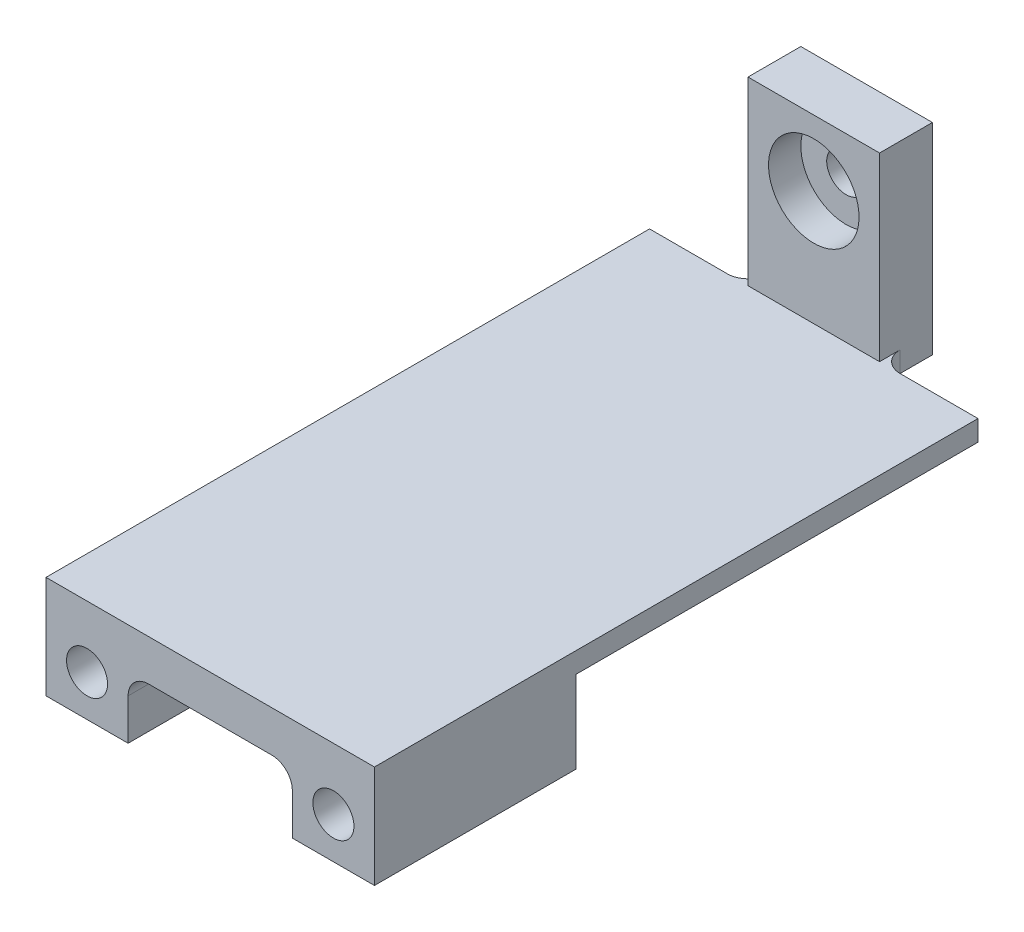
ISO-10303-21;
HEADER;
FILE_DESCRIPTION(('STEP AP214'),'2;1');
FILE_NAME('part.step','',(''),(''),'','','');
FILE_SCHEMA(('AUTOMOTIVE_DESIGN { 1 0 10303 214 1 1 1 1 }'));
ENDSEC;
DATA;
#1=APPLICATION_CONTEXT('core data for automotive mechanical design processes');
#2=APPLICATION_PROTOCOL_DEFINITION('international standard','automotive_design',2000,#1);
#3=PRODUCT_CONTEXT('',#1,'mechanical');
#4=PRODUCT('Part','Part','',(#3));
#5=PRODUCT_RELATED_PRODUCT_CATEGORY('part','',(#4));
#6=PRODUCT_DEFINITION_FORMATION('','',#4);
#7=PRODUCT_DEFINITION_CONTEXT('part definition',#1,'design');
#8=PRODUCT_DEFINITION('design','',#6,#7);
#9=PRODUCT_DEFINITION_SHAPE('','',#8);
#10=(LENGTH_UNIT() NAMED_UNIT(*) SI_UNIT(.MILLI.,.METRE.));
#11=(NAMED_UNIT(*) PLANE_ANGLE_UNIT() SI_UNIT($,.RADIAN.));
#12=(NAMED_UNIT(*) SI_UNIT($,.STERADIAN.) SOLID_ANGLE_UNIT());
#13=UNCERTAINTY_MEASURE_WITH_UNIT(LENGTH_MEASURE(1.E-05),#10,'distance_accuracy_value','');
#14=(GEOMETRIC_REPRESENTATION_CONTEXT(3) GLOBAL_UNCERTAINTY_ASSIGNED_CONTEXT((#13)) GLOBAL_UNIT_ASSIGNED_CONTEXT((#10,
#11,#12)) REPRESENTATION_CONTEXT('',''));
#15=CARTESIAN_POINT('',(0.,0.,0.));
#16=DIRECTION('',(0.,0.,1.));
#17=DIRECTION('',(1.,0.,0.));
#18=AXIS2_PLACEMENT_3D('',#15,#16,#17);
#19=CARTESIAN_POINT('',(88.9,12.7,50.8));
#20=DIRECTION('',(-1.,0.,0.));
#21=DIRECTION('',(0.,0.,1.));
#22=AXIS2_PLACEMENT_3D('',#19,#20,#21);
#23=PLANE('',#22);
#24=DIRECTION('',(0.,-1.,0.));
#25=VECTOR('',#24,1.);
#26=CARTESIAN_POINT('',(88.9,-19.05,-11.55));
#27=LINE('',#26,#25);
#28=CARTESIAN_POINT('',(88.9,6.35,-11.55));
#29=VERTEX_POINT('',#28);
#30=CARTESIAN_POINT('',(88.9,-19.05,-11.55));
#31=VERTEX_POINT('',#30);
#32=EDGE_CURVE('E178',#29,#31,#27,.T.);
#33=ORIENTED_EDGE('',*,*,#32,.F.);
#34=DIRECTION('',(0.,0.,1.));
#35=VECTOR('',#34,1.);
#36=CARTESIAN_POINT('',(88.9,6.35,-50.8));
#37=LINE('',#36,#35);
#38=CARTESIAN_POINT('',(88.9,6.35,-135.89));
#39=VERTEX_POINT('',#38);
#40=EDGE_CURVE('E340',#39,#29,#37,.T.);
#41=ORIENTED_EDGE('',*,*,#40,.F.);
#42=DIRECTION('',(0.,-1.,0.));
#43=VECTOR('',#42,1.);
#44=CARTESIAN_POINT('',(88.9,12.7,-135.89));
#45=LINE('',#44,#43);
#46=CARTESIAN_POINT('',(88.9,12.7,-135.89));
#47=VERTEX_POINT('',#46);
#48=EDGE_CURVE('E296',#47,#39,#45,.T.);
#49=ORIENTED_EDGE('',*,*,#48,.F.);
#50=DIRECTION('',(0.,0.,-1.));
#51=VECTOR('',#50,1.);
#52=CARTESIAN_POINT('',(88.9,12.7,50.8));
#53=LINE('',#52,#51);
#54=CARTESIAN_POINT('',(88.9,12.7,50.8));
#55=VERTEX_POINT('',#54);
#56=EDGE_CURVE('E228',#55,#47,#53,.T.);
#57=ORIENTED_EDGE('',*,*,#56,.F.);
#58=DIRECTION('',(0.,-1.,0.));
#59=VECTOR('',#58,1.);
#60=CARTESIAN_POINT('',(88.9,12.7,50.8));
#61=LINE('',#60,#59);
#62=CARTESIAN_POINT('',(88.9,-19.05,50.8));
#63=VERTEX_POINT('',#62);
#64=EDGE_CURVE('E203',#55,#63,#61,.T.);
#65=ORIENTED_EDGE('',*,*,#64,.T.);
#66=DIRECTION('',(0.,0.,1.));
#67=VECTOR('',#66,1.);
#68=CARTESIAN_POINT('',(88.9,-19.05,-82.55));
#69=LINE('',#68,#67);
#70=EDGE_CURVE('E196',#31,#63,#69,.T.);
#71=ORIENTED_EDGE('',*,*,#70,.F.);
#72=EDGE_LOOP('',(#33,#41,#49,#57,#65,#71));
#73=FACE_BOUND('',#72,.T.);
#74=ADVANCED_FACE('F40',(#73),#23,.F.);
#75=CARTESIAN_POINT('',(-12.7,-19.05,-82.55));
#76=DIRECTION('',(-1.,0.,0.));
#77=DIRECTION('',(0.,0.,1.));
#78=AXIS2_PLACEMENT_3D('',#75,#76,#77);
#79=PLANE('',#78);
#80=DIRECTION('',(0.,0.,-1.));
#81=VECTOR('',#80,1.);
#82=CARTESIAN_POINT('',(-12.7,6.35,-82.55));
#83=LINE('',#82,#81);
#84=CARTESIAN_POINT('',(-12.7,6.35,-11.55));
#85=VERTEX_POINT('',#84);
#86=CARTESIAN_POINT('',(-12.7,6.35,-135.89));
#87=VERTEX_POINT('',#86);
#88=EDGE_CURVE('E330',#85,#87,#83,.T.);
#89=ORIENTED_EDGE('',*,*,#88,.F.);
#90=DIRECTION('',(0.,1.,0.));
#91=VECTOR('',#90,1.);
#92=CARTESIAN_POINT('',(-12.7,-19.05,-11.55));
#93=LINE('',#92,#91);
#94=CARTESIAN_POINT('',(-12.7,-19.05,-11.55));
#95=VERTEX_POINT('',#94);
#96=EDGE_CURVE('E199',#95,#85,#93,.T.);
#97=ORIENTED_EDGE('',*,*,#96,.F.);
#98=DIRECTION('',(0.,0.,1.));
#99=VECTOR('',#98,1.);
#100=CARTESIAN_POINT('',(-12.7,-19.05,-82.55));
#101=LINE('',#100,#99);
#102=CARTESIAN_POINT('',(-12.7,-19.05,50.8));
#103=VERTEX_POINT('',#102);
#104=EDGE_CURVE('E224',#95,#103,#101,.T.);
#105=ORIENTED_EDGE('',*,*,#104,.T.);
#106=DIRECTION('',(0.,-1.,0.));
#107=VECTOR('',#106,1.);
#108=CARTESIAN_POINT('',(-12.7,-19.05,50.8));
#109=LINE('',#108,#107);
#110=CARTESIAN_POINT('',(-12.7,12.7,50.8));
#111=VERTEX_POINT('',#110);
#112=EDGE_CURVE('E220',#111,#103,#109,.T.);
#113=ORIENTED_EDGE('',*,*,#112,.F.);
#114=DIRECTION('',(0.,0.,-1.));
#115=VECTOR('',#114,1.);
#116=CARTESIAN_POINT('',(-12.7,12.7,133.35));
#117=LINE('',#116,#115);
#118=CARTESIAN_POINT('',(-12.7,12.7,-135.89));
#119=VERTEX_POINT('',#118);
#120=EDGE_CURVE('E285',#111,#119,#117,.T.);
#121=ORIENTED_EDGE('',*,*,#120,.T.);
#122=DIRECTION('',(0.,1.,0.));
#123=VECTOR('',#122,1.);
#124=CARTESIAN_POINT('',(-12.7,12.7,-135.89));
#125=LINE('',#124,#123);
#126=EDGE_CURVE('E282',#87,#119,#125,.T.);
#127=ORIENTED_EDGE('',*,*,#126,.F.);
#128=EDGE_LOOP('',(#89,#97,#105,#113,#121,#127));
#129=FACE_BOUND('',#128,.T.);
#130=ADVANCED_FACE('F403',(#129),#79,.T.);
#131=CARTESIAN_POINT('',(38.1,48.26,-152.24));
#132=DIRECTION('',(0.,0.,1.));
#133=DIRECTION('',(1.,0.,0.));
#134=AXIS2_PLACEMENT_3D('',#131,#132,#133);
#135=CYLINDRICAL_SURFACE('',#134,5.99999999999999);
#136=CARTESIAN_POINT('',(38.1,48.26,-152.24));
#137=DIRECTION('',(0.,0.,-1.));
#138=DIRECTION('',(-1.,0.,0.));
#139=AXIS2_PLACEMENT_3D('',#136,#137,#138);
#140=CIRCLE('',#139,5.99999999999999);
#141=CARTESIAN_POINT('',(32.1,48.26,-152.24));
#142=VERTEX_POINT('',#141);
#143=EDGE_CURVE('E253',#142,#142,#140,.T.);
#144=ORIENTED_EDGE('',*,*,#143,.T.);
#145=EDGE_LOOP('',(#144));
#146=FACE_BOUND('',#145,.T.);
#147=CARTESIAN_POINT('',(38.1,48.26,-145.89));
#148=DIRECTION('',(0.,0.,1.));
#149=DIRECTION('',(1.,0.,0.));
#150=AXIS2_PLACEMENT_3D('',#147,#148,#149);
#151=CIRCLE('',#150,5.99999999999999);
#152=CARTESIAN_POINT('',(44.1,48.26,-145.89));
#153=VERTEX_POINT('',#152);
#154=EDGE_CURVE('E250',#153,#153,#151,.T.);
#155=ORIENTED_EDGE('',*,*,#154,.T.);
#156=EDGE_LOOP('',(#155));
#157=FACE_BOUND('',#156,.T.);
#158=ADVANCED_FACE('F408',(#146,#157),#135,.F.);
#159=CARTESIAN_POINT('',(0.,0.,-135.89));
#160=DIRECTION('',(0.,0.,-1.));
#161=DIRECTION('',(-1.,0.,0.));
#162=AXIS2_PLACEMENT_3D('',#159,#160,#161);
#163=PLANE('',#162);
#164=DIRECTION('',(1.,0.,0.));
#165=VECTOR('',#164,1.);
#166=CARTESIAN_POINT('',(0.,6.35,-135.89));
#167=LINE('',#166,#165);
#168=CARTESIAN_POINT('',(11.4,6.35,-135.89));
#169=VERTEX_POINT('',#168);
#170=EDGE_CURVE('E55',#87,#169,#167,.T.);
#171=ORIENTED_EDGE('',*,*,#170,.F.);
#172=ORIENTED_EDGE('',*,*,#126,.T.);
#173=DIRECTION('',(1.,0.,0.));
#174=VECTOR('',#173,1.);
#175=CARTESIAN_POINT('',(88.9,12.7,-135.89));
#176=LINE('',#175,#174);
#177=CARTESIAN_POINT('',(11.4,12.7,-135.89));
#178=VERTEX_POINT('',#177);
#179=EDGE_CURVE('E281',#119,#178,#176,.T.);
#180=ORIENTED_EDGE('',*,*,#179,.T.);
#181=DIRECTION('',(0.,1.,0.));
#182=VECTOR('',#181,1.);
#183=CARTESIAN_POINT('',(11.4,0.,-135.89));
#184=LINE('',#183,#182);
#185=EDGE_CURVE('E265',#178,#169,#184,.F.);
#186=ORIENTED_EDGE('',*,*,#185,.T.);
#187=EDGE_LOOP('',(#171,#172,#180,#186));
#188=FACE_BOUND('',#187,.T.);
#189=ADVANCED_FACE('F278',(#188),#163,.T.);
#190=CARTESIAN_POINT('',(0.,0.,0.));
#191=DIRECTION('',(0.,-1.,0.));
#192=DIRECTION('',(0.,0.,-1.));
#193=AXIS2_PLACEMENT_3D('',#190,#191,#192);
#194=PLANE('',#193);
#195=DIRECTION('',(-1.,0.,0.));
#196=VECTOR('',#195,1.);
#197=CARTESIAN_POINT('',(0.,0.,-11.55));
#198=LINE('',#197,#196);
#199=CARTESIAN_POINT('',(57.15,0.,-11.55));
#200=VERTEX_POINT('',#199);
#201=CARTESIAN_POINT('',(19.05,0.,-11.55));
#202=VERTEX_POINT('',#201);
#203=EDGE_CURVE('E353',#200,#202,#198,.T.);
#204=ORIENTED_EDGE('',*,*,#203,.F.);
#205=DIRECTION('',(0.,0.,1.));
#206=VECTOR('',#205,1.);
#207=CARTESIAN_POINT('',(57.15,0.,0.));
#208=LINE('',#207,#206);
#209=CARTESIAN_POINT('',(57.15,0.,50.8));
#210=VERTEX_POINT('',#209);
#211=EDGE_CURVE('E239',#200,#210,#208,.T.);
#212=ORIENTED_EDGE('',*,*,#211,.T.);
#213=DIRECTION('',(1.,0.,0.));
#214=VECTOR('',#213,1.);
#215=CARTESIAN_POINT('',(-88.9,0.,50.8));
#216=LINE('',#215,#214);
#217=CARTESIAN_POINT('',(19.05,0.,50.8));
#218=VERTEX_POINT('',#217);
#219=EDGE_CURVE('E226',#218,#210,#216,.T.);
#220=ORIENTED_EDGE('',*,*,#219,.F.);
#221=DIRECTION('',(0.,0.,1.));
#222=VECTOR('',#221,1.);
#223=CARTESIAN_POINT('',(19.05,0.,-50.8));
#224=LINE('',#223,#222);
#225=EDGE_CURVE('E236',#218,#202,#224,.F.);
#226=ORIENTED_EDGE('',*,*,#225,.T.);
#227=EDGE_LOOP('',(#204,#212,#220,#226));
#228=FACE_BOUND('',#227,.T.);
#229=ADVANCED_FACE('F457',(#228),#194,.T.);
#230=CARTESIAN_POINT('',(-88.9,12.7,50.8));
#231=DIRECTION('',(0.,0.,-1.));
#232=DIRECTION('',(-1.,0.,0.));
#233=AXIS2_PLACEMENT_3D('',#230,#231,#232);
#234=PLANE('',#233);
#235=CARTESIAN_POINT('',(76.2,-6.35,50.8));
#236=DIRECTION('',(0.,0.,1.));
#237=DIRECTION('',(1.,0.,0.));
#238=AXIS2_PLACEMENT_3D('',#235,#236,#237);
#239=CIRCLE('',#238,6.35);
#240=CARTESIAN_POINT('',(82.55,-6.35,50.8));
#241=VERTEX_POINT('',#240);
#242=EDGE_CURVE('E289',#241,#241,#239,.T.);
#243=ORIENTED_EDGE('',*,*,#242,.F.);
#244=EDGE_LOOP('',(#243));
#245=FACE_BOUND('',#244,.T.);
#246=CARTESIAN_POINT('',(0.,-6.35,50.8));
#247=DIRECTION('',(0.,0.,1.));
#248=DIRECTION('',(1.,0.,0.));
#249=AXIS2_PLACEMENT_3D('',#246,#247,#248);
#250=CIRCLE('',#249,6.35);
#251=CARTESIAN_POINT('',(6.35,-6.35,50.8));
#252=VERTEX_POINT('',#251);
#253=EDGE_CURVE('E205',#252,#252,#250,.T.);
#254=ORIENTED_EDGE('',*,*,#253,.F.);
#255=EDGE_LOOP('',(#254));
#256=FACE_BOUND('',#255,.T.);
#257=DIRECTION('',(1.,0.,0.));
#258=VECTOR('',#257,1.);
#259=CARTESIAN_POINT('',(-88.9,12.7,50.8));
#260=LINE('',#259,#258);
#261=EDGE_CURVE('E231',#111,#55,#260,.T.);
#262=ORIENTED_EDGE('',*,*,#261,.F.);
#263=ORIENTED_EDGE('',*,*,#112,.T.);
#264=DIRECTION('',(1.,0.,0.));
#265=VECTOR('',#264,1.);
#266=CARTESIAN_POINT('',(12.7,-19.05,50.8));
#267=LINE('',#266,#265);
#268=CARTESIAN_POINT('',(12.7,-19.05,50.8));
#269=VERTEX_POINT('',#268);
#270=EDGE_CURVE('E208',#103,#269,#267,.T.);
#271=ORIENTED_EDGE('',*,*,#270,.T.);
#272=DIRECTION('',(0.,1.,0.));
#273=VECTOR('',#272,1.);
#274=CARTESIAN_POINT('',(12.7,-19.05,50.8));
#275=LINE('',#274,#273);
#276=CARTESIAN_POINT('',(12.7,-6.35,50.8));
#277=VERTEX_POINT('',#276);
#278=EDGE_CURVE('E217',#269,#277,#275,.T.);
#279=ORIENTED_EDGE('',*,*,#278,.T.);
#280=CARTESIAN_POINT('',(19.05,-6.35,50.8));
#281=DIRECTION('',(0.,0.,-1.));
#282=DIRECTION('',(-1.,0.,0.));
#283=AXIS2_PLACEMENT_3D('',#280,#281,#282);
#284=CIRCLE('',#283,6.35);
#285=EDGE_CURVE('E248',#277,#218,#284,.T.);
#286=ORIENTED_EDGE('',*,*,#285,.T.);
#287=ORIENTED_EDGE('',*,*,#219,.T.);
#288=CARTESIAN_POINT('',(57.15,-6.35,50.8));
#289=DIRECTION('',(0.,0.,-1.));
#290=DIRECTION('',(-1.,0.,0.));
#291=AXIS2_PLACEMENT_3D('',#288,#289,#290);
#292=CIRCLE('',#291,6.35);
#293=CARTESIAN_POINT('',(63.5,-6.35,50.8));
#294=VERTEX_POINT('',#293);
#295=EDGE_CURVE('E246',#210,#294,#292,.T.);
#296=ORIENTED_EDGE('',*,*,#295,.T.);
#297=DIRECTION('',(0.,1.,0.));
#298=VECTOR('',#297,1.);
#299=CARTESIAN_POINT('',(63.5,-19.05,50.8));
#300=LINE('',#299,#298);
#301=CARTESIAN_POINT('',(63.5,-19.05,50.8));
#302=VERTEX_POINT('',#301);
#303=EDGE_CURVE('E495',#302,#294,#300,.T.);
#304=ORIENTED_EDGE('',*,*,#303,.F.);
#305=DIRECTION('',(-1.,0.,0.));
#306=VECTOR('',#305,1.);
#307=CARTESIAN_POINT('',(88.9,-19.05,50.8));
#308=LINE('',#307,#306);
#309=EDGE_CURVE('E210',#63,#302,#308,.T.);
#310=ORIENTED_EDGE('',*,*,#309,.F.);
#311=ORIENTED_EDGE('',*,*,#64,.F.);
#312=EDGE_LOOP('',(#262,#263,#271,#279,#286,#287,#296,#304,#310,#311));
#313=FACE_BOUND('',#312,.T.);
#314=ADVANCED_FACE('F412',(#245,#256,#313),#234,.F.);
#315=CARTESIAN_POINT('',(0.,12.7,0.));
#316=DIRECTION('',(0.,-1.,0.));
#317=DIRECTION('',(0.,0.,-1.));
#318=AXIS2_PLACEMENT_3D('',#315,#316,#317);
#319=PLANE('',#318);
#320=ORIENTED_EDGE('',*,*,#56,.T.);
#321=CARTESIAN_POINT('',(64.8,12.7,-135.89));
#322=VERTEX_POINT('',#321);
#323=EDGE_CURVE('E288',#322,#47,#176,.T.);
#324=ORIENTED_EDGE('',*,*,#323,.F.);
#325=CARTESIAN_POINT('',(64.8,12.7,-142.24));
#326=DIRECTION('',(0.,-1.,0.));
#327=DIRECTION('',(0.,0.,-1.));
#328=AXIS2_PLACEMENT_3D('',#325,#326,#327);
#329=CIRCLE('',#328,6.35);
#330=CARTESIAN_POINT('',(58.45,12.7,-142.24));
#331=VERTEX_POINT('',#330);
#332=EDGE_CURVE('E268',#322,#331,#329,.T.);
#333=ORIENTED_EDGE('',*,*,#332,.T.);
#334=DIRECTION('',(0.,0.,-1.));
#335=VECTOR('',#334,1.);
#336=CARTESIAN_POINT('',(58.45,12.7,0.));
#337=LINE('',#336,#335);
#338=CARTESIAN_POINT('',(58.45,12.7,-135.89));
#339=VERTEX_POINT('',#338);
#340=EDGE_CURVE('E63',#339,#331,#337,.T.);
#341=ORIENTED_EDGE('',*,*,#340,.F.);
#342=CARTESIAN_POINT('',(17.75,12.7,-135.89));
#343=VERTEX_POINT('',#342);
#344=EDGE_CURVE('E286',#343,#339,#176,.T.);
#345=ORIENTED_EDGE('',*,*,#344,.F.);
#346=DIRECTION('',(0.,0.,1.));
#347=VECTOR('',#346,1.);
#348=CARTESIAN_POINT('',(17.75,12.7,0.));
#349=LINE('',#348,#347);
#350=CARTESIAN_POINT('',(17.75,12.7,-142.24));
#351=VERTEX_POINT('',#350);
#352=EDGE_CURVE('E261',#351,#343,#349,.T.);
#353=ORIENTED_EDGE('',*,*,#352,.F.);
#354=CARTESIAN_POINT('',(11.4,12.7,-142.24));
#355=DIRECTION('',(0.,-1.,0.));
#356=DIRECTION('',(0.,0.,-1.));
#357=AXIS2_PLACEMENT_3D('',#354,#355,#356);
#358=CIRCLE('',#357,6.35);
#359=EDGE_CURVE('E270',#351,#178,#358,.T.);
#360=ORIENTED_EDGE('',*,*,#359,.T.);
#361=ORIENTED_EDGE('',*,*,#179,.F.);
#362=ORIENTED_EDGE('',*,*,#120,.F.);
#363=ORIENTED_EDGE('',*,*,#261,.T.);
#364=EDGE_LOOP('',(#320,#324,#333,#341,#345,#353,#360,#361,#362,#363));
#365=FACE_BOUND('',#364,.T.);
#366=ADVANCED_FACE('F371',(#365),#319,.F.);
#367=CARTESIAN_POINT('',(12.7,-19.05,-82.55));
#368=DIRECTION('',(0.,-1.,0.));
#369=DIRECTION('',(0.,0.,-1.));
#370=AXIS2_PLACEMENT_3D('',#367,#368,#369);
#371=PLANE('',#370);
#372=DIRECTION('',(-1.,0.,0.));
#373=VECTOR('',#372,1.);
#374=CARTESIAN_POINT('',(88.9,-19.05,-11.55));
#375=LINE('',#374,#373);
#376=CARTESIAN_POINT('',(12.7,-19.05,-11.55));
#377=VERTEX_POINT('',#376);
#378=EDGE_CURVE('E190',#377,#95,#375,.T.);
#379=ORIENTED_EDGE('',*,*,#378,.F.);
#380=DIRECTION('',(0.,0.,1.));
#381=VECTOR('',#380,1.);
#382=CARTESIAN_POINT('',(12.7,-19.05,-82.55));
#383=LINE('',#382,#381);
#384=EDGE_CURVE('E223',#377,#269,#383,.T.);
#385=ORIENTED_EDGE('',*,*,#384,.T.);
#386=ORIENTED_EDGE('',*,*,#270,.F.);
#387=ORIENTED_EDGE('',*,*,#104,.F.);
#388=EDGE_LOOP('',(#379,#385,#386,#387));
#389=FACE_BOUND('',#388,.T.);
#390=ADVANCED_FACE('F470',(#389),#371,.T.);
#391=CARTESIAN_POINT('',(12.7,-19.05,-82.55));
#392=DIRECTION('',(1.,0.,0.));
#393=DIRECTION('',(0.,1.,0.));
#394=AXIS2_PLACEMENT_3D('',#391,#392,#393);
#395=PLANE('',#394);
#396=DIRECTION('',(0.,-1.,0.));
#397=VECTOR('',#396,1.);
#398=CARTESIAN_POINT('',(12.7,-19.05,-11.55));
#399=LINE('',#398,#397);
#400=CARTESIAN_POINT('',(12.7,-6.35,-11.55));
#401=VERTEX_POINT('',#400);
#402=EDGE_CURVE('E355',#401,#377,#399,.T.);
#403=ORIENTED_EDGE('',*,*,#402,.F.);
#404=DIRECTION('',(0.,0.,1.));
#405=VECTOR('',#404,1.);
#406=CARTESIAN_POINT('',(12.7,-6.35,50.8));
#407=LINE('',#406,#405);
#408=EDGE_CURVE('E244',#401,#277,#407,.T.);
#409=ORIENTED_EDGE('',*,*,#408,.T.);
#410=ORIENTED_EDGE('',*,*,#278,.F.);
#411=ORIENTED_EDGE('',*,*,#384,.F.);
#412=EDGE_LOOP('',(#403,#409,#410,#411));
#413=FACE_BOUND('',#412,.T.);
#414=ADVANCED_FACE('F473',(#413),#395,.T.);
#415=CARTESIAN_POINT('',(0.,-6.35,-68.7605122421383));
#416=DIRECTION('',(0.,0.,1.));
#417=DIRECTION('',(1.,0.,0.));
#418=AXIS2_PLACEMENT_3D('',#415,#416,#417);
#419=CYLINDRICAL_SURFACE('',#418,6.35);
#420=CARTESIAN_POINT('',(0.,-6.35,-11.55));
#421=DIRECTION('',(0.,0.,1.));
#422=DIRECTION('',(1.,0.,0.));
#423=AXIS2_PLACEMENT_3D('',#420,#421,#422);
#424=CIRCLE('',#423,6.35);
#425=CARTESIAN_POINT('',(6.35,-6.35,-11.55));
#426=VERTEX_POINT('',#425);
#427=EDGE_CURVE('E342',#426,#426,#424,.F.);
#428=ORIENTED_EDGE('',*,*,#427,.T.);
#429=EDGE_LOOP('',(#428));
#430=FACE_BOUND('',#429,.T.);
#431=ORIENTED_EDGE('',*,*,#253,.T.);
#432=EDGE_LOOP('',(#431));
#433=FACE_BOUND('',#432,.T.);
#434=ADVANCED_FACE('F476',(#430,#433),#419,.F.);
#435=CARTESIAN_POINT('',(63.5,-19.05,-82.55));
#436=DIRECTION('',(1.,0.,0.));
#437=DIRECTION('',(0.,0.,-1.));
#438=AXIS2_PLACEMENT_3D('',#435,#436,#437);
#439=PLANE('',#438);
#440=DIRECTION('',(0.,0.,1.));
#441=VECTOR('',#440,1.);
#442=CARTESIAN_POINT('',(63.5,-6.35,-82.55));
#443=LINE('',#442,#441);
#444=CARTESIAN_POINT('',(63.5,-6.35,-11.55));
#445=VERTEX_POINT('',#444);
#446=EDGE_CURVE('E241',#294,#445,#443,.F.);
#447=ORIENTED_EDGE('',*,*,#446,.T.);
#448=DIRECTION('',(0.,-1.,0.));
#449=VECTOR('',#448,1.);
#450=CARTESIAN_POINT('',(63.5,-19.05,-11.55));
#451=LINE('',#450,#449);
#452=CARTESIAN_POINT('',(63.5,-19.05,-11.55));
#453=VERTEX_POINT('',#452);
#454=EDGE_CURVE('E348',#445,#453,#451,.T.);
#455=ORIENTED_EDGE('',*,*,#454,.T.);
#456=DIRECTION('',(0.,0.,1.));
#457=VECTOR('',#456,1.);
#458=CARTESIAN_POINT('',(63.5,-19.05,-82.55));
#459=LINE('',#458,#457);
#460=EDGE_CURVE('E198',#453,#302,#459,.T.);
#461=ORIENTED_EDGE('',*,*,#460,.T.);
#462=ORIENTED_EDGE('',*,*,#303,.T.);
#463=EDGE_LOOP('',(#447,#455,#461,#462));
#464=FACE_BOUND('',#463,.T.);
#465=ADVANCED_FACE('F481',(#464),#439,.F.);
#466=CARTESIAN_POINT('',(88.9,-19.05,-82.55));
#467=DIRECTION('',(0.,1.,0.));
#468=DIRECTION('',(0.,0.,1.));
#469=AXIS2_PLACEMENT_3D('',#466,#467,#468);
#470=PLANE('',#469);
#471=ORIENTED_EDGE('',*,*,#460,.F.);
#472=EDGE_CURVE('E182',#31,#453,#375,.T.);
#473=ORIENTED_EDGE('',*,*,#472,.F.);
#474=ORIENTED_EDGE('',*,*,#70,.T.);
#475=ORIENTED_EDGE('',*,*,#309,.T.);
#476=EDGE_LOOP('',(#471,#473,#474,#475));
#477=FACE_BOUND('',#476,.T.);
#478=ADVANCED_FACE('F194',(#477),#470,.F.);
#479=CARTESIAN_POINT('',(76.2,-6.35,-68.7605122421383));
#480=DIRECTION('',(0.,0.,1.));
#481=DIRECTION('',(1.,0.,0.));
#482=AXIS2_PLACEMENT_3D('',#479,#480,#481);
#483=CYLINDRICAL_SURFACE('',#482,6.35);
#484=CARTESIAN_POINT('',(76.2,-6.35,-11.55));
#485=DIRECTION('',(0.,0.,1.));
#486=DIRECTION('',(1.,0.,0.));
#487=AXIS2_PLACEMENT_3D('',#484,#485,#486);
#488=CIRCLE('',#487,6.35);
#489=CARTESIAN_POINT('',(82.55,-6.35,-11.55));
#490=VERTEX_POINT('',#489);
#491=EDGE_CURVE('E345',#490,#490,#488,.F.);
#492=ORIENTED_EDGE('',*,*,#491,.T.);
#493=EDGE_LOOP('',(#492));
#494=FACE_BOUND('',#493,.T.);
#495=ORIENTED_EDGE('',*,*,#242,.T.);
#496=EDGE_LOOP('',(#495));
#497=FACE_BOUND('',#496,.T.);
#498=ADVANCED_FACE('F418',(#494,#497),#483,.F.);
#499=CARTESIAN_POINT('',(57.15,-6.35,0.));
#500=DIRECTION('',(0.,0.,1.));
#501=DIRECTION('',(1.,0.,0.));
#502=AXIS2_PLACEMENT_3D('',#499,#500,#501);
#503=CYLINDRICAL_SURFACE('',#502,6.35);
#504=ORIENTED_EDGE('',*,*,#211,.F.);
#505=CARTESIAN_POINT('',(57.15,-6.35,-11.55));
#506=DIRECTION('',(0.,0.,1.));
#507=DIRECTION('',(1.,0.,0.));
#508=AXIS2_PLACEMENT_3D('',#505,#506,#507);
#509=CIRCLE('',#508,6.35);
#510=EDGE_CURVE('E350',#200,#445,#509,.F.);
#511=ORIENTED_EDGE('',*,*,#510,.T.);
#512=ORIENTED_EDGE('',*,*,#446,.F.);
#513=ORIENTED_EDGE('',*,*,#295,.F.);
#514=EDGE_LOOP('',(#504,#511,#512,#513));
#515=FACE_BOUND('',#514,.T.);
#516=ADVANCED_FACE('F414',(#515),#503,.F.);
#517=CARTESIAN_POINT('',(19.05,-6.35,-82.55));
#518=DIRECTION('',(0.,0.,-1.));
#519=DIRECTION('',(-1.,0.,0.));
#520=AXIS2_PLACEMENT_3D('',#517,#518,#519);
#521=CYLINDRICAL_SURFACE('',#520,6.35);
#522=ORIENTED_EDGE('',*,*,#408,.F.);
#523=CARTESIAN_POINT('',(19.05,-6.35,-11.55));
#524=DIRECTION('',(0.,0.,1.));
#525=DIRECTION('',(1.,0.,0.));
#526=AXIS2_PLACEMENT_3D('',#523,#524,#525);
#527=CIRCLE('',#526,6.35);
#528=EDGE_CURVE('E11',#401,#202,#527,.F.);
#529=ORIENTED_EDGE('',*,*,#528,.T.);
#530=ORIENTED_EDGE('',*,*,#225,.F.);
#531=ORIENTED_EDGE('',*,*,#285,.F.);
#532=EDGE_LOOP('',(#522,#529,#530,#531));
#533=FACE_BOUND('',#532,.T.);
#534=ADVANCED_FACE('F417',(#533),#521,.F.);
#535=DIRECTION('',(1.,0.,0.));
#536=VECTOR('',#535,1.);
#537=CARTESIAN_POINT('',(0.,6.35,-135.89));
#538=LINE('',#537,#536);
#539=CARTESIAN_POINT('',(64.8,6.35,-135.89));
#540=VERTEX_POINT('',#539);
#541=EDGE_CURVE('E323',#540,#39,#538,.T.);
#542=ORIENTED_EDGE('',*,*,#541,.F.);
#543=DIRECTION('',(0.,-1.,0.));
#544=VECTOR('',#543,1.);
#545=CARTESIAN_POINT('',(64.8,0.,-135.89));
#546=LINE('',#545,#544);
#547=EDGE_CURVE('E259',#540,#322,#546,.F.);
#548=ORIENTED_EDGE('',*,*,#547,.T.);
#549=ORIENTED_EDGE('',*,*,#323,.T.);
#550=ORIENTED_EDGE('',*,*,#48,.T.);
#551=EDGE_LOOP('',(#542,#548,#549,#550));
#552=FACE_BOUND('',#551,.T.);
#553=ADVANCED_FACE('F365',(#552),#163,.T.);
#554=CARTESIAN_POINT('',(0.,0.,-135.89));
#555=DIRECTION('',(0.,0.,-1.));
#556=DIRECTION('',(-1.,0.,0.));
#557=AXIS2_PLACEMENT_3D('',#554,#555,#556);
#558=PLANE('',#557);
#559=CARTESIAN_POINT('',(38.1,48.26,-135.89));
#560=DIRECTION('',(0.,0.,1.));
#561=DIRECTION('',(1.,0.,0.));
#562=AXIS2_PLACEMENT_3D('',#559,#560,#561);
#563=CIRCLE('',#562,14.);
#564=CARTESIAN_POINT('',(52.1,48.26,-135.89));
#565=VERTEX_POINT('',#564);
#566=EDGE_CURVE('E320',#565,#565,#563,.T.);
#567=ORIENTED_EDGE('',*,*,#566,.F.);
#568=EDGE_LOOP('',(#567));
#569=FACE_BOUND('',#568,.T.);
#570=DIRECTION('',(0.,1.,0.));
#571=VECTOR('',#570,1.);
#572=CARTESIAN_POINT('',(17.75,0.,-135.89));
#573=LINE('',#572,#571);
#574=CARTESIAN_POINT('',(17.75,68.61,-135.89));
#575=VERTEX_POINT('',#574);
#576=EDGE_CURVE('E311',#343,#575,#573,.T.);
#577=ORIENTED_EDGE('',*,*,#576,.F.);
#578=ORIENTED_EDGE('',*,*,#344,.T.);
#579=DIRECTION('',(0.,-1.,0.));
#580=VECTOR('',#579,1.);
#581=CARTESIAN_POINT('',(58.45,0.,-135.89));
#582=LINE('',#581,#580);
#583=CARTESIAN_POINT('',(58.45,68.61,-135.89));
#584=VERTEX_POINT('',#583);
#585=EDGE_CURVE('E306',#584,#339,#582,.T.);
#586=ORIENTED_EDGE('',*,*,#585,.F.);
#587=DIRECTION('',(1.,0.,0.));
#588=VECTOR('',#587,1.);
#589=CARTESIAN_POINT('',(17.75,68.61,-135.89));
#590=LINE('',#589,#588);
#591=EDGE_CURVE('E309',#575,#584,#590,.T.);
#592=ORIENTED_EDGE('',*,*,#591,.F.);
#593=EDGE_LOOP('',(#577,#578,#586,#592));
#594=FACE_BOUND('',#593,.T.);
#595=ADVANCED_FACE('F380',(#569,#594),#558,.F.);
#596=CARTESIAN_POINT('',(0.,0.,-152.24));
#597=DIRECTION('',(0.,0.,-1.));
#598=DIRECTION('',(-1.,0.,0.));
#599=AXIS2_PLACEMENT_3D('',#596,#597,#598);
#600=PLANE('',#599);
#601=DIRECTION('',(1.,0.,0.));
#602=VECTOR('',#601,1.);
#603=CARTESIAN_POINT('',(0.,6.35,-152.24));
#604=LINE('',#603,#602);
#605=CARTESIAN_POINT('',(17.75,6.35,-152.24));
#606=VERTEX_POINT('',#605);
#607=CARTESIAN_POINT('',(58.45,6.35,-152.24));
#608=VERTEX_POINT('',#607);
#609=EDGE_CURVE('E336',#606,#608,#604,.T.);
#610=ORIENTED_EDGE('',*,*,#609,.F.);
#611=DIRECTION('',(0.,1.,0.));
#612=VECTOR('',#611,1.);
#613=CARTESIAN_POINT('',(17.75,0.,-152.24));
#614=LINE('',#613,#612);
#615=CARTESIAN_POINT('',(17.75,68.61,-152.24));
#616=VERTEX_POINT('',#615);
#617=EDGE_CURVE('E308',#606,#616,#614,.T.);
#618=ORIENTED_EDGE('',*,*,#617,.T.);
#619=DIRECTION('',(1.,0.,0.));
#620=VECTOR('',#619,1.);
#621=CARTESIAN_POINT('',(17.75,68.61,-152.24));
#622=LINE('',#621,#620);
#623=CARTESIAN_POINT('',(58.45,68.61,-152.24));
#624=VERTEX_POINT('',#623);
#625=EDGE_CURVE('E315',#616,#624,#622,.T.);
#626=ORIENTED_EDGE('',*,*,#625,.T.);
#627=DIRECTION('',(0.,-1.,0.));
#628=VECTOR('',#627,1.);
#629=CARTESIAN_POINT('',(58.45,0.,-152.24));
#630=LINE('',#629,#628);
#631=EDGE_CURVE('E305',#624,#608,#630,.T.);
#632=ORIENTED_EDGE('',*,*,#631,.T.);
#633=EDGE_LOOP('',(#610,#618,#626,#632));
#634=FACE_BOUND('',#633,.T.);
#635=ORIENTED_EDGE('',*,*,#143,.F.);
#636=EDGE_LOOP('',(#635));
#637=FACE_BOUND('',#636,.T.);
#638=ADVANCED_FACE('F388',(#634,#637),#600,.T.);
#639=CARTESIAN_POINT('',(17.75,0.,-152.24));
#640=DIRECTION('',(1.,0.,0.));
#641=DIRECTION('',(0.,0.,-1.));
#642=AXIS2_PLACEMENT_3D('',#639,#640,#641);
#643=PLANE('',#642);
#644=ORIENTED_EDGE('',*,*,#617,.F.);
#645=DIRECTION('',(0.,0.,1.));
#646=VECTOR('',#645,1.);
#647=CARTESIAN_POINT('',(17.75,6.35,-152.24));
#648=LINE('',#647,#646);
#649=CARTESIAN_POINT('',(17.75,6.35,-142.24));
#650=VERTEX_POINT('',#649);
#651=EDGE_CURVE('E338',#606,#650,#648,.T.);
#652=ORIENTED_EDGE('',*,*,#651,.T.);
#653=DIRECTION('',(0.,1.,0.));
#654=VECTOR('',#653,1.);
#655=CARTESIAN_POINT('',(17.75,0.,-142.24));
#656=LINE('',#655,#654);
#657=EDGE_CURVE('E263',#650,#351,#656,.T.);
#658=ORIENTED_EDGE('',*,*,#657,.T.);
#659=ORIENTED_EDGE('',*,*,#352,.T.);
#660=ORIENTED_EDGE('',*,*,#576,.T.);
#661=DIRECTION('',(0.,0.,1.));
#662=VECTOR('',#661,1.);
#663=CARTESIAN_POINT('',(17.75,68.61,-152.24));
#664=LINE('',#663,#662);
#665=EDGE_CURVE('E297',#616,#575,#664,.T.);
#666=ORIENTED_EDGE('',*,*,#665,.F.);
#667=EDGE_LOOP('',(#644,#652,#658,#659,#660,#666));
#668=FACE_BOUND('',#667,.T.);
#669=ADVANCED_FACE('F384',(#668),#643,.F.);
#670=CARTESIAN_POINT('',(17.75,68.61,-152.24));
#671=DIRECTION('',(0.,-1.,0.));
#672=DIRECTION('',(0.,0.,-1.));
#673=AXIS2_PLACEMENT_3D('',#670,#671,#672);
#674=PLANE('',#673);
#675=ORIENTED_EDGE('',*,*,#591,.T.);
#676=DIRECTION('',(0.,0.,1.));
#677=VECTOR('',#676,1.);
#678=CARTESIAN_POINT('',(58.45,68.61,-152.24));
#679=LINE('',#678,#677);
#680=EDGE_CURVE('E302',#624,#584,#679,.T.);
#681=ORIENTED_EDGE('',*,*,#680,.F.);
#682=ORIENTED_EDGE('',*,*,#625,.F.);
#683=ORIENTED_EDGE('',*,*,#665,.T.);
#684=EDGE_LOOP('',(#675,#681,#682,#683));
#685=FACE_BOUND('',#684,.T.);
#686=ADVANCED_FACE('F392',(#685),#674,.F.);
#687=CARTESIAN_POINT('',(58.45,0.,-152.24));
#688=DIRECTION('',(-1.,0.,0.));
#689=DIRECTION('',(0.,0.,1.));
#690=AXIS2_PLACEMENT_3D('',#687,#688,#689);
#691=PLANE('',#690);
#692=DIRECTION('',(0.,-1.,0.));
#693=VECTOR('',#692,1.);
#694=CARTESIAN_POINT('',(58.45,0.,-142.24));
#695=LINE('',#694,#693);
#696=CARTESIAN_POINT('',(58.45,6.35,-142.24));
#697=VERTEX_POINT('',#696);
#698=EDGE_CURVE('E256',#331,#697,#695,.T.);
#699=ORIENTED_EDGE('',*,*,#698,.T.);
#700=DIRECTION('',(0.,0.,-1.));
#701=VECTOR('',#700,1.);
#702=CARTESIAN_POINT('',(58.45,6.35,-152.24));
#703=LINE('',#702,#701);
#704=EDGE_CURVE('E332',#697,#608,#703,.T.);
#705=ORIENTED_EDGE('',*,*,#704,.T.);
#706=ORIENTED_EDGE('',*,*,#631,.F.);
#707=ORIENTED_EDGE('',*,*,#680,.T.);
#708=ORIENTED_EDGE('',*,*,#585,.T.);
#709=ORIENTED_EDGE('',*,*,#340,.T.);
#710=EDGE_LOOP('',(#699,#705,#706,#707,#708,#709));
#711=FACE_BOUND('',#710,.T.);
#712=ADVANCED_FACE('F373',(#711),#691,.F.);
#713=CARTESIAN_POINT('',(38.1,48.26,-145.89));
#714=DIRECTION('',(0.,0.,1.));
#715=DIRECTION('',(1.,0.,0.));
#716=AXIS2_PLACEMENT_3D('',#713,#714,#715);
#717=CYLINDRICAL_SURFACE('',#716,14.);
#718=CARTESIAN_POINT('',(38.1,48.26,-145.89));
#719=DIRECTION('',(0.,0.,1.));
#720=DIRECTION('',(1.,0.,0.));
#721=AXIS2_PLACEMENT_3D('',#718,#719,#720);
#722=CIRCLE('',#721,14.);
#723=CARTESIAN_POINT('',(52.1,48.26,-145.89));
#724=VERTEX_POINT('',#723);
#725=EDGE_CURVE('E254',#724,#724,#722,.T.);
#726=ORIENTED_EDGE('',*,*,#725,.F.);
#727=EDGE_LOOP('',(#726));
#728=FACE_BOUND('',#727,.T.);
#729=ORIENTED_EDGE('',*,*,#566,.T.);
#730=EDGE_LOOP('',(#729));
#731=FACE_BOUND('',#730,.T.);
#732=ADVANCED_FACE('F399',(#728,#731),#717,.F.);
#733=CARTESIAN_POINT('',(38.1,48.26,-145.89));
#734=DIRECTION('',(0.,0.,1.));
#735=DIRECTION('',(1.,0.,0.));
#736=AXIS2_PLACEMENT_3D('',#733,#734,#735);
#737=PLANE('',#736);
#738=ORIENTED_EDGE('',*,*,#154,.F.);
#739=EDGE_LOOP('',(#738));
#740=FACE_BOUND('',#739,.T.);
#741=ORIENTED_EDGE('',*,*,#725,.T.);
#742=EDGE_LOOP('',(#741));
#743=FACE_BOUND('',#742,.T.);
#744=ADVANCED_FACE('F423',(#740,#743),#737,.T.);
#745=CARTESIAN_POINT('',(64.8,0.,-142.24));
#746=DIRECTION('',(0.,-1.,0.));
#747=DIRECTION('',(0.,0.,-1.));
#748=AXIS2_PLACEMENT_3D('',#745,#746,#747);
#749=CYLINDRICAL_SURFACE('',#748,6.35);
#750=ORIENTED_EDGE('',*,*,#547,.F.);
#751=CARTESIAN_POINT('',(64.8,6.35,-142.24));
#752=DIRECTION('',(0.,1.,0.));
#753=DIRECTION('',(0.,0.,1.));
#754=AXIS2_PLACEMENT_3D('',#751,#752,#753);
#755=CIRCLE('',#754,6.35);
#756=EDGE_CURVE('E327',#540,#697,#755,.F.);
#757=ORIENTED_EDGE('',*,*,#756,.T.);
#758=ORIENTED_EDGE('',*,*,#698,.F.);
#759=ORIENTED_EDGE('',*,*,#332,.F.);
#760=EDGE_LOOP('',(#750,#757,#758,#759));
#761=FACE_BOUND('',#760,.T.);
#762=ADVANCED_FACE('F369',(#761),#749,.F.);
#763=CARTESIAN_POINT('',(11.4,0.,-142.24));
#764=DIRECTION('',(0.,1.,0.));
#765=DIRECTION('',(0.,0.,1.));
#766=AXIS2_PLACEMENT_3D('',#763,#764,#765);
#767=CYLINDRICAL_SURFACE('',#766,6.35);
#768=ORIENTED_EDGE('',*,*,#657,.F.);
#769=CARTESIAN_POINT('',(11.4,6.35,-142.24));
#770=DIRECTION('',(0.,1.,0.));
#771=DIRECTION('',(0.,0.,1.));
#772=AXIS2_PLACEMENT_3D('',#769,#770,#771);
#773=CIRCLE('',#772,6.35);
#774=EDGE_CURVE('E48',#650,#169,#773,.F.);
#775=ORIENTED_EDGE('',*,*,#774,.T.);
#776=ORIENTED_EDGE('',*,*,#185,.F.);
#777=ORIENTED_EDGE('',*,*,#359,.F.);
#778=EDGE_LOOP('',(#768,#775,#776,#777));
#779=FACE_BOUND('',#778,.T.);
#780=ADVANCED_FACE('F42',(#779),#767,.F.);
#781=CARTESIAN_POINT('',(0.,6.35,0.));
#782=DIRECTION('',(0.,1.,0.));
#783=DIRECTION('',(0.,0.,1.));
#784=AXIS2_PLACEMENT_3D('',#781,#782,#783);
#785=PLANE('',#784);
#786=ORIENTED_EDGE('',*,*,#40,.T.);
#787=DIRECTION('',(1.,0.,0.));
#788=VECTOR('',#787,1.);
#789=CARTESIAN_POINT('',(88.9,6.35,-11.55));
#790=LINE('',#789,#788);
#791=EDGE_CURVE('E186',#85,#29,#790,.T.);
#792=ORIENTED_EDGE('',*,*,#791,.F.);
#793=ORIENTED_EDGE('',*,*,#88,.T.);
#794=ORIENTED_EDGE('',*,*,#170,.T.);
#795=ORIENTED_EDGE('',*,*,#774,.F.);
#796=ORIENTED_EDGE('',*,*,#651,.F.);
#797=ORIENTED_EDGE('',*,*,#609,.T.);
#798=ORIENTED_EDGE('',*,*,#704,.F.);
#799=ORIENTED_EDGE('',*,*,#756,.F.);
#800=ORIENTED_EDGE('',*,*,#541,.T.);
#801=EDGE_LOOP('',(#786,#792,#793,#794,#795,#796,#797,#798,#799,#800));
#802=FACE_BOUND('',#801,.T.);
#803=ADVANCED_FACE('F362',(#802),#785,.F.);
#804=CARTESIAN_POINT('',(0.,0.,-11.55));
#805=DIRECTION('',(0.,0.,1.));
#806=DIRECTION('',(1.,0.,0.));
#807=AXIS2_PLACEMENT_3D('',#804,#805,#806);
#808=PLANE('',#807);
#809=ORIENTED_EDGE('',*,*,#491,.F.);
#810=EDGE_LOOP('',(#809));
#811=FACE_BOUND('',#810,.T.);
#812=ORIENTED_EDGE('',*,*,#510,.F.);
#813=ORIENTED_EDGE('',*,*,#203,.T.);
#814=ORIENTED_EDGE('',*,*,#528,.F.);
#815=ORIENTED_EDGE('',*,*,#402,.T.);
#816=ORIENTED_EDGE('',*,*,#378,.T.);
#817=ORIENTED_EDGE('',*,*,#96,.T.);
#818=ORIENTED_EDGE('',*,*,#791,.T.);
#819=ORIENTED_EDGE('',*,*,#32,.T.);
#820=ORIENTED_EDGE('',*,*,#472,.T.);
#821=ORIENTED_EDGE('',*,*,#454,.F.);
#822=EDGE_LOOP('',(#812,#813,#814,#815,#816,#817,#818,#819,#820,#821));
#823=FACE_BOUND('',#822,.T.);
#824=ORIENTED_EDGE('',*,*,#427,.F.);
#825=EDGE_LOOP('',(#824));
#826=FACE_BOUND('',#825,.T.);
#827=ADVANCED_FACE('F180',(#811,#823,#826),#808,.F.);
#828=CLOSED_SHELL('',(#74,#130,#158,#189,#229,#314,#366,#390,#414,#434,#465,#478,#498,#516,#534,
#553,#595,#638,#669,#686,#712,#732,#744,#762,#780,#803,#827));
#829=MANIFOLD_SOLID_BREP('B2',#828);
#830=ADVANCED_BREP_SHAPE_REPRESENTATION('',(#18,#829),#14);
#831=SHAPE_DEFINITION_REPRESENTATION(#9,#830);
ENDSEC;
END-ISO-10303-21;
